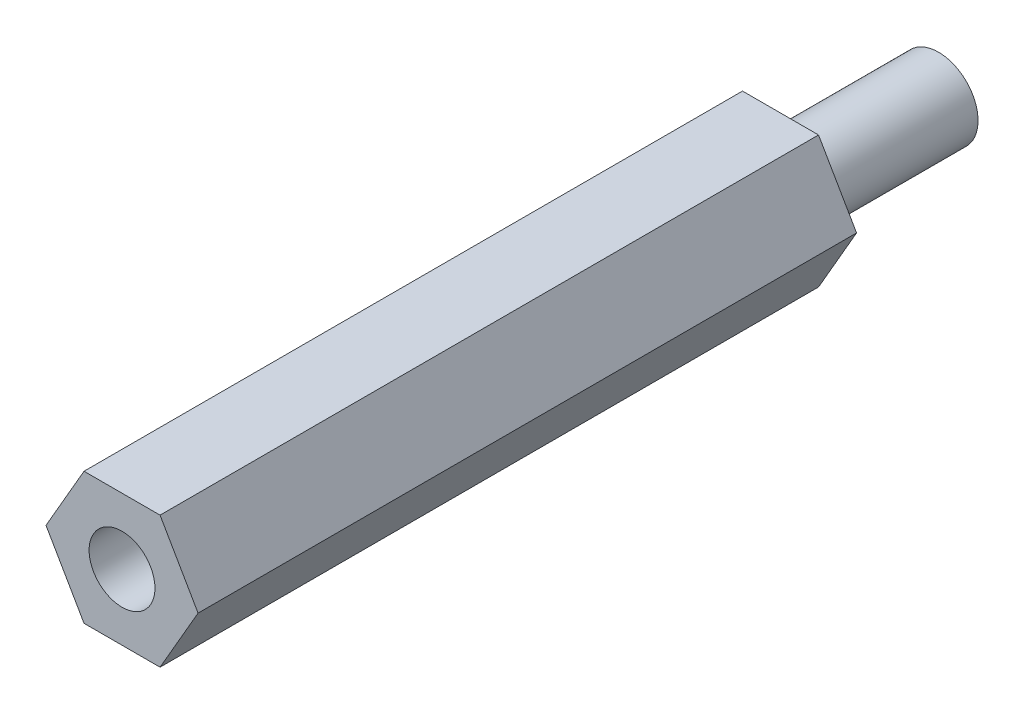
ISO-10303-21;
HEADER;
FILE_DESCRIPTION(('STEP AP214'),'2;1');
FILE_NAME('part.step','',(''),(''),'','','');
FILE_SCHEMA(('AUTOMOTIVE_DESIGN { 1 0 10303 214 1 1 1 1 }'));
ENDSEC;
DATA;
#1=APPLICATION_CONTEXT('core data for automotive mechanical design processes');
#2=APPLICATION_PROTOCOL_DEFINITION('international standard','automotive_design',2000,#1);
#3=PRODUCT_CONTEXT('',#1,'mechanical');
#4=PRODUCT('Part','Part','',(#3));
#5=PRODUCT_RELATED_PRODUCT_CATEGORY('part','',(#4));
#6=PRODUCT_DEFINITION_FORMATION('','',#4);
#7=PRODUCT_DEFINITION_CONTEXT('part definition',#1,'design');
#8=PRODUCT_DEFINITION('design','',#6,#7);
#9=PRODUCT_DEFINITION_SHAPE('','',#8);
#10=(LENGTH_UNIT() NAMED_UNIT(*) SI_UNIT(.MILLI.,.METRE.));
#11=(NAMED_UNIT(*) PLANE_ANGLE_UNIT() SI_UNIT($,.RADIAN.));
#12=(NAMED_UNIT(*) SI_UNIT($,.STERADIAN.) SOLID_ANGLE_UNIT());
#13=UNCERTAINTY_MEASURE_WITH_UNIT(LENGTH_MEASURE(1.E-05),#10,'distance_accuracy_value','');
#14=(GEOMETRIC_REPRESENTATION_CONTEXT(3) GLOBAL_UNCERTAINTY_ASSIGNED_CONTEXT((#13)) GLOBAL_UNIT_ASSIGNED_CONTEXT((#10,
#11,#12)) REPRESENTATION_CONTEXT('',''));
#15=CARTESIAN_POINT('',(0.,0.,0.));
#16=DIRECTION('',(0.,0.,1.));
#17=DIRECTION('',(1.,0.,0.));
#18=AXIS2_PLACEMENT_3D('',#15,#16,#17);
#19=CARTESIAN_POINT('',(1.44337567297406,2.5,25.));
#20=DIRECTION('',(0.,-1.,0.));
#21=DIRECTION('',(1.,0.,0.));
#22=AXIS2_PLACEMENT_3D('',#19,#20,#21);
#23=PLANE('',#22);
#24=DIRECTION('',(-1.,0.,0.));
#25=VECTOR('',#24,1.);
#26=CARTESIAN_POINT('',(1.44337567297406,2.5,0.));
#27=LINE('',#26,#25);
#28=CARTESIAN_POINT('',(1.44337567297406,2.5,0.));
#29=VERTEX_POINT('',#28);
#30=CARTESIAN_POINT('',(-1.44337567297407,2.5,0.));
#31=VERTEX_POINT('',#30);
#32=EDGE_CURVE('E125',#29,#31,#27,.T.);
#33=ORIENTED_EDGE('',*,*,#32,.T.);
#34=DIRECTION('',(0.,0.,-1.));
#35=VECTOR('',#34,1.);
#36=CARTESIAN_POINT('',(-1.44337567297407,2.5,25.));
#37=LINE('',#36,#35);
#38=CARTESIAN_POINT('',(-1.44337567297407,2.5,25.));
#39=VERTEX_POINT('',#38);
#40=EDGE_CURVE('E40',#39,#31,#37,.T.);
#41=ORIENTED_EDGE('',*,*,#40,.F.);
#42=DIRECTION('',(-1.,0.,0.));
#43=VECTOR('',#42,1.);
#44=CARTESIAN_POINT('',(1.44337567297406,2.5,25.));
#45=LINE('',#44,#43);
#46=CARTESIAN_POINT('',(1.44337567297406,2.5,25.));
#47=VERTEX_POINT('',#46);
#48=EDGE_CURVE('E136',#47,#39,#45,.T.);
#49=ORIENTED_EDGE('',*,*,#48,.F.);
#50=DIRECTION('',(0.,0.,-1.));
#51=VECTOR('',#50,1.);
#52=CARTESIAN_POINT('',(1.44337567297406,2.5,25.));
#53=LINE('',#52,#51);
#54=EDGE_CURVE('E121',#47,#29,#53,.T.);
#55=ORIENTED_EDGE('',*,*,#54,.T.);
#56=EDGE_LOOP('',(#33,#41,#49,#55));
#57=FACE_BOUND('',#56,.T.);
#58=ADVANCED_FACE('F37',(#57),#23,.F.);
#59=CARTESIAN_POINT('',(-1.44337567297407,2.5,25.));
#60=DIRECTION('',(0.866025403784439,-0.5,0.));
#61=DIRECTION('',(0.5,0.866025403784439,0.));
#62=AXIS2_PLACEMENT_3D('',#59,#60,#61);
#63=PLANE('',#62);
#64=DIRECTION('',(-0.5,-0.866025403784439,0.));
#65=VECTOR('',#64,1.);
#66=CARTESIAN_POINT('',(-1.44337567297407,2.5,0.));
#67=LINE('',#66,#65);
#68=CARTESIAN_POINT('',(-2.88675134594813,0.,0.));
#69=VERTEX_POINT('',#68);
#70=EDGE_CURVE('E128',#31,#69,#67,.T.);
#71=ORIENTED_EDGE('',*,*,#70,.T.);
#72=DIRECTION('',(0.,0.,-1.));
#73=VECTOR('',#72,1.);
#74=CARTESIAN_POINT('',(-2.88675134594813,0.,25.));
#75=LINE('',#74,#73);
#76=CARTESIAN_POINT('',(-2.88675134594813,0.,25.));
#77=VERTEX_POINT('',#76);
#78=EDGE_CURVE('E139',#77,#69,#75,.T.);
#79=ORIENTED_EDGE('',*,*,#78,.F.);
#80=DIRECTION('',(-0.5,-0.866025403784439,0.));
#81=VECTOR('',#80,1.);
#82=CARTESIAN_POINT('',(-1.44337567297407,2.5,25.));
#83=LINE('',#82,#81);
#84=EDGE_CURVE('E93',#39,#77,#83,.T.);
#85=ORIENTED_EDGE('',*,*,#84,.F.);
#86=ORIENTED_EDGE('',*,*,#40,.T.);
#87=EDGE_LOOP('',(#71,#79,#85,#86));
#88=FACE_BOUND('',#87,.T.);
#89=ADVANCED_FACE('F144',(#88),#63,.F.);
#90=CARTESIAN_POINT('',(-2.88675134594813,0.,25.));
#91=DIRECTION('',(0.866025403784438,0.5,0.));
#92=DIRECTION('',(-0.5,0.866025403784438,0.));
#93=AXIS2_PLACEMENT_3D('',#90,#91,#92);
#94=PLANE('',#93);
#95=DIRECTION('',(0.5,-0.866025403784438,0.));
#96=VECTOR('',#95,1.);
#97=CARTESIAN_POINT('',(-2.88675134594813,0.,0.));
#98=LINE('',#97,#96);
#99=CARTESIAN_POINT('',(-1.44337567297406,-2.5,0.));
#100=VERTEX_POINT('',#99);
#101=EDGE_CURVE('E131',#69,#100,#98,.T.);
#102=ORIENTED_EDGE('',*,*,#101,.T.);
#103=DIRECTION('',(0.,0.,-1.));
#104=VECTOR('',#103,1.);
#105=CARTESIAN_POINT('',(-1.44337567297406,-2.5,25.));
#106=LINE('',#105,#104);
#107=CARTESIAN_POINT('',(-1.44337567297406,-2.5,25.));
#108=VERTEX_POINT('',#107);
#109=EDGE_CURVE('E116',#108,#100,#106,.T.);
#110=ORIENTED_EDGE('',*,*,#109,.F.);
#111=DIRECTION('',(0.5,-0.866025403784438,0.));
#112=VECTOR('',#111,1.);
#113=CARTESIAN_POINT('',(-2.88675134594813,0.,25.));
#114=LINE('',#113,#112);
#115=EDGE_CURVE('E107',#77,#108,#114,.T.);
#116=ORIENTED_EDGE('',*,*,#115,.F.);
#117=ORIENTED_EDGE('',*,*,#78,.T.);
#118=EDGE_LOOP('',(#102,#110,#116,#117));
#119=FACE_BOUND('',#118,.T.);
#120=ADVANCED_FACE('F150',(#119),#94,.F.);
#121=CARTESIAN_POINT('',(-1.44337567297406,-2.5,25.));
#122=DIRECTION('',(0.,1.,0.));
#123=DIRECTION('',(-1.,0.,0.));
#124=AXIS2_PLACEMENT_3D('',#121,#122,#123);
#125=PLANE('',#124);
#126=DIRECTION('',(1.,0.,0.));
#127=VECTOR('',#126,1.);
#128=CARTESIAN_POINT('',(-1.44337567297406,-2.5,0.));
#129=LINE('',#128,#127);
#130=CARTESIAN_POINT('',(1.44337567297407,-2.5,0.));
#131=VERTEX_POINT('',#130);
#132=EDGE_CURVE('E115',#100,#131,#129,.T.);
#133=ORIENTED_EDGE('',*,*,#132,.T.);
#134=DIRECTION('',(0.,0.,-1.));
#135=VECTOR('',#134,1.);
#136=CARTESIAN_POINT('',(1.44337567297407,-2.5,25.));
#137=LINE('',#136,#135);
#138=CARTESIAN_POINT('',(1.44337567297407,-2.5,25.));
#139=VERTEX_POINT('',#138);
#140=EDGE_CURVE('E112',#139,#131,#137,.T.);
#141=ORIENTED_EDGE('',*,*,#140,.F.);
#142=DIRECTION('',(1.,0.,0.));
#143=VECTOR('',#142,1.);
#144=CARTESIAN_POINT('',(-1.44337567297406,-2.5,25.));
#145=LINE('',#144,#143);
#146=EDGE_CURVE('E101',#108,#139,#145,.T.);
#147=ORIENTED_EDGE('',*,*,#146,.F.);
#148=ORIENTED_EDGE('',*,*,#109,.T.);
#149=EDGE_LOOP('',(#133,#141,#147,#148));
#150=FACE_BOUND('',#149,.T.);
#151=ADVANCED_FACE('F113',(#150),#125,.F.);
#152=CARTESIAN_POINT('',(1.44337567297407,-2.5,25.));
#153=DIRECTION('',(-0.866025403784439,0.5,0.));
#154=DIRECTION('',(-0.5,-0.866025403784439,0.));
#155=AXIS2_PLACEMENT_3D('',#152,#153,#154);
#156=PLANE('',#155);
#157=DIRECTION('',(0.5,0.866025403784439,0.));
#158=VECTOR('',#157,1.);
#159=CARTESIAN_POINT('',(1.44337567297407,-2.5,0.));
#160=LINE('',#159,#158);
#161=CARTESIAN_POINT('',(2.88675134594813,0.,0.));
#162=VERTEX_POINT('',#161);
#163=EDGE_CURVE('E78',#131,#162,#160,.T.);
#164=ORIENTED_EDGE('',*,*,#163,.T.);
#165=DIRECTION('',(0.,0.,-1.));
#166=VECTOR('',#165,1.);
#167=CARTESIAN_POINT('',(2.88675134594813,0.,25.));
#168=LINE('',#167,#166);
#169=CARTESIAN_POINT('',(2.88675134594813,0.,25.));
#170=VERTEX_POINT('',#169);
#171=EDGE_CURVE('E117',#170,#162,#168,.T.);
#172=ORIENTED_EDGE('',*,*,#171,.F.);
#173=DIRECTION('',(0.5,0.866025403784439,0.));
#174=VECTOR('',#173,1.);
#175=CARTESIAN_POINT('',(1.44337567297407,-2.5,25.));
#176=LINE('',#175,#174);
#177=EDGE_CURVE('E105',#139,#170,#176,.T.);
#178=ORIENTED_EDGE('',*,*,#177,.F.);
#179=ORIENTED_EDGE('',*,*,#140,.T.);
#180=EDGE_LOOP('',(#164,#172,#178,#179));
#181=FACE_BOUND('',#180,.T.);
#182=ADVANCED_FACE('F119',(#181),#156,.F.);
#183=CARTESIAN_POINT('',(2.88675134594813,0.,25.));
#184=DIRECTION('',(-0.866025403784439,-0.5,0.));
#185=DIRECTION('',(0.5,-0.866025403784439,0.));
#186=AXIS2_PLACEMENT_3D('',#183,#184,#185);
#187=PLANE('',#186);
#188=DIRECTION('',(-0.5,0.866025403784439,0.));
#189=VECTOR('',#188,1.);
#190=CARTESIAN_POINT('',(2.88675134594813,0.,0.));
#191=LINE('',#190,#189);
#192=EDGE_CURVE('E84',#162,#29,#191,.T.);
#193=ORIENTED_EDGE('',*,*,#192,.T.);
#194=ORIENTED_EDGE('',*,*,#54,.F.);
#195=DIRECTION('',(-0.5,0.866025403784439,0.));
#196=VECTOR('',#195,1.);
#197=CARTESIAN_POINT('',(2.88675134594813,0.,25.));
#198=LINE('',#197,#196);
#199=EDGE_CURVE('E54',#170,#47,#198,.T.);
#200=ORIENTED_EDGE('',*,*,#199,.F.);
#201=ORIENTED_EDGE('',*,*,#171,.T.);
#202=EDGE_LOOP('',(#193,#194,#200,#201));
#203=FACE_BOUND('',#202,.T.);
#204=ADVANCED_FACE('F166',(#203),#187,.F.);
#205=CARTESIAN_POINT('',(0.,0.,25.));
#206=DIRECTION('',(0.,0.,1.));
#207=DIRECTION('',(1.,0.,0.));
#208=AXIS2_PLACEMENT_3D('',#205,#206,#207);
#209=PLANE('',#208);
#210=CARTESIAN_POINT('',(0.,0.,25.));
#211=DIRECTION('',(0.,0.,1.));
#212=DIRECTION('',(1.,0.,0.));
#213=AXIS2_PLACEMENT_3D('',#210,#211,#212);
#214=CIRCLE('',#213,1.24999999999999);
#215=CARTESIAN_POINT('',(1.24999999999999,0.,25.));
#216=VERTEX_POINT('',#215);
#217=EDGE_CURVE('E159',#216,#216,#214,.T.);
#218=ORIENTED_EDGE('',*,*,#217,.F.);
#219=EDGE_LOOP('',(#218));
#220=FACE_BOUND('',#219,.T.);
#221=ORIENTED_EDGE('',*,*,#48,.T.);
#222=ORIENTED_EDGE('',*,*,#84,.T.);
#223=ORIENTED_EDGE('',*,*,#115,.T.);
#224=ORIENTED_EDGE('',*,*,#146,.T.);
#225=ORIENTED_EDGE('',*,*,#177,.T.);
#226=ORIENTED_EDGE('',*,*,#199,.T.);
#227=EDGE_LOOP('',(#221,#222,#223,#224,#225,#226));
#228=FACE_BOUND('',#227,.T.);
#229=ADVANCED_FACE('F103',(#220,#228),#209,.T.);
#230=CARTESIAN_POINT('',(0.,0.,0.));
#231=DIRECTION('',(0.,0.,1.));
#232=DIRECTION('',(1.,0.,0.));
#233=AXIS2_PLACEMENT_3D('',#230,#231,#232);
#234=PLANE('',#233);
#235=CARTESIAN_POINT('',(0.,0.,0.));
#236=DIRECTION('',(0.,0.,-1.));
#237=DIRECTION('',(-1.,0.,0.));
#238=AXIS2_PLACEMENT_3D('',#235,#236,#237);
#239=CIRCLE('',#238,1.5);
#240=CARTESIAN_POINT('',(-1.5,0.,0.));
#241=VERTEX_POINT('',#240);
#242=EDGE_CURVE('E11',#241,#241,#239,.T.);
#243=ORIENTED_EDGE('',*,*,#242,.F.);
#244=EDGE_LOOP('',(#243));
#245=FACE_BOUND('',#244,.T.);
#246=ORIENTED_EDGE('',*,*,#32,.F.);
#247=ORIENTED_EDGE('',*,*,#192,.F.);
#248=ORIENTED_EDGE('',*,*,#163,.F.);
#249=ORIENTED_EDGE('',*,*,#132,.F.);
#250=ORIENTED_EDGE('',*,*,#101,.F.);
#251=ORIENTED_EDGE('',*,*,#70,.F.);
#252=EDGE_LOOP('',(#246,#247,#248,#249,#250,#251));
#253=FACE_BOUND('',#252,.T.);
#254=ADVANCED_FACE('F149',(#245,#253),#234,.F.);
#255=CARTESIAN_POINT('',(0.,0.,-6.));
#256=DIRECTION('',(0.,0.,1.));
#257=DIRECTION('',(1.,0.,0.));
#258=AXIS2_PLACEMENT_3D('',#255,#256,#257);
#259=CYLINDRICAL_SURFACE('',#258,1.5);
#260=CARTESIAN_POINT('',(0.,0.,-6.));
#261=DIRECTION('',(0.,0.,-1.));
#262=DIRECTION('',(-1.,0.,0.));
#263=AXIS2_PLACEMENT_3D('',#260,#261,#262);
#264=CIRCLE('',#263,1.5);
#265=CARTESIAN_POINT('',(-1.5,0.,-6.));
#266=VERTEX_POINT('',#265);
#267=EDGE_CURVE('E129',#266,#266,#264,.T.);
#268=ORIENTED_EDGE('',*,*,#267,.F.);
#269=EDGE_LOOP('',(#268));
#270=FACE_BOUND('',#269,.T.);
#271=ORIENTED_EDGE('',*,*,#242,.T.);
#272=EDGE_LOOP('',(#271));
#273=FACE_BOUND('',#272,.T.);
#274=ADVANCED_FACE('F172',(#270,#273),#259,.T.);
#275=CARTESIAN_POINT('',(0.,0.,-6.));
#276=DIRECTION('',(0.,0.,-1.));
#277=DIRECTION('',(-1.,0.,0.));
#278=AXIS2_PLACEMENT_3D('',#275,#276,#277);
#279=PLANE('',#278);
#280=ORIENTED_EDGE('',*,*,#267,.T.);
#281=EDGE_LOOP('',(#280));
#282=FACE_BOUND('',#281,.T.);
#283=ADVANCED_FACE('F213',(#282),#279,.T.);
#284=CARTESIAN_POINT('',(0.,0.,17.5));
#285=DIRECTION('',(0.,0.,1.));
#286=DIRECTION('',(1.,0.,0.));
#287=AXIS2_PLACEMENT_3D('',#284,#285,#286);
#288=CONICAL_SURFACE('',#287,1.25,1.02974425867665);
#289=CARTESIAN_POINT('',(0.,0.,16.7489242262155));
#290=VERTEX_POINT('',#289);
#291=VERTEX_LOOP('',#290);
#292=FACE_BOUND('',#291,.T.);
#293=CARTESIAN_POINT('',(0.,0.,17.5));
#294=DIRECTION('',(0.,0.,1.));
#295=DIRECTION('',(1.,0.,0.));
#296=AXIS2_PLACEMENT_3D('',#293,#294,#295);
#297=CIRCLE('',#296,1.25);
#298=CARTESIAN_POINT('',(1.25,0.,17.5));
#299=VERTEX_POINT('',#298);
#300=EDGE_CURVE('E156',#299,#299,#297,.T.);
#301=ORIENTED_EDGE('',*,*,#300,.T.);
#302=EDGE_LOOP('',(#301));
#303=FACE_BOUND('',#302,.T.);
#304=ADVANCED_FACE('F221',(#292,#303),#288,.F.);
#305=CARTESIAN_POINT('',(0.,0.,25.));
#306=DIRECTION('',(0.,0.,1.));
#307=DIRECTION('',(1.,0.,0.));
#308=AXIS2_PLACEMENT_3D('',#305,#306,#307);
#309=CYLINDRICAL_SURFACE('',#308,1.24999999999999);
#310=ORIENTED_EDGE('',*,*,#300,.F.);
#311=EDGE_LOOP('',(#310));
#312=FACE_BOUND('',#311,.T.);
#313=ORIENTED_EDGE('',*,*,#217,.T.);
#314=EDGE_LOOP('',(#313));
#315=FACE_BOUND('',#314,.T.);
#316=ADVANCED_FACE('F163',(#312,#315),#309,.F.);
#317=CLOSED_SHELL('',(#58,#89,#120,#151,#182,#204,#229,#254,#274,#283,#304,#316));
#318=MANIFOLD_SOLID_BREP('B2',#317);
#319=ADVANCED_BREP_SHAPE_REPRESENTATION('',(#18,#318),#14);
#320=SHAPE_DEFINITION_REPRESENTATION(#9,#319);
ENDSEC;
END-ISO-10303-21;
